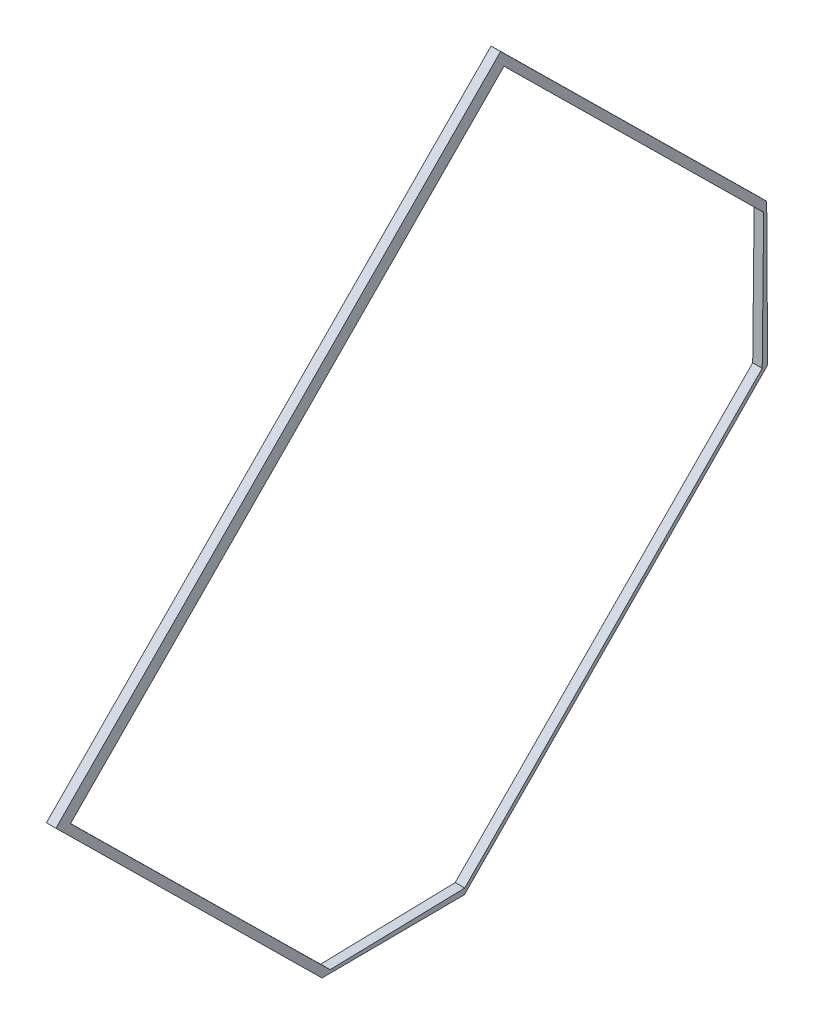
ISO-10303-21;
HEADER;
FILE_DESCRIPTION(('STEP AP214'),'2;1');
FILE_NAME('part.step','',(''),(''),'','','');
FILE_SCHEMA(('AUTOMOTIVE_DESIGN { 1 0 10303 214 1 1 1 1 }'));
ENDSEC;
DATA;
#1=APPLICATION_CONTEXT('core data for automotive mechanical design processes');
#2=APPLICATION_PROTOCOL_DEFINITION('international standard','automotive_design',2000,#1);
#3=PRODUCT_CONTEXT('',#1,'mechanical');
#4=PRODUCT('Part','Part','',(#3));
#5=PRODUCT_RELATED_PRODUCT_CATEGORY('part','',(#4));
#6=PRODUCT_DEFINITION_FORMATION('','',#4);
#7=PRODUCT_DEFINITION_CONTEXT('part definition',#1,'design');
#8=PRODUCT_DEFINITION('design','',#6,#7);
#9=PRODUCT_DEFINITION_SHAPE('','',#8);
#10=(LENGTH_UNIT() NAMED_UNIT(*) SI_UNIT(.MILLI.,.METRE.));
#11=(NAMED_UNIT(*) PLANE_ANGLE_UNIT() SI_UNIT($,.RADIAN.));
#12=(NAMED_UNIT(*) SI_UNIT($,.STERADIAN.) SOLID_ANGLE_UNIT());
#13=UNCERTAINTY_MEASURE_WITH_UNIT(LENGTH_MEASURE(1.E-05),#10,'distance_accuracy_value','');
#14=(GEOMETRIC_REPRESENTATION_CONTEXT(3) GLOBAL_UNCERTAINTY_ASSIGNED_CONTEXT((#13)) GLOBAL_UNIT_ASSIGNED_CONTEXT((#10,
#11,#12)) REPRESENTATION_CONTEXT('',''));
#15=CARTESIAN_POINT('',(0.,0.,0.));
#16=DIRECTION('',(0.,0.,1.));
#17=DIRECTION('',(1.,0.,0.));
#18=AXIS2_PLACEMENT_3D('',#15,#16,#17);
#19=CARTESIAN_POINT('',(6.7035911293097,59.99886640719,-145.054810919189));
#20=DIRECTION('',(-1.,0.,0.));
#21=DIRECTION('',(0.,0.711600971417974,-0.702583843734679));
#22=AXIS2_PLACEMENT_3D('',#19,#20,#21);
#23=PLANE('',#22);
#24=DIRECTION('',(0.,0.702583843734679,0.711600971417974));
#25=VECTOR('',#24,1.);
#26=CARTESIAN_POINT('',(6.70359112930971,197.00974177389,-6.28550548296942));
#27=LINE('',#26,#25);
#28=CARTESIAN_POINT('',(6.70359112930971,113.978246225248,-90.3826469381793));
#29=VERTEX_POINT('',#28);
#30=CARTESIAN_POINT('',(6.70359112930971,197.00974177389,-6.28550548296942));
#31=VERTEX_POINT('',#30);
#32=EDGE_CURVE('E134',#29,#31,#27,.T.);
#33=ORIENTED_EDGE('',*,*,#32,.F.);
#34=DIRECTION('',(0.,-0.999979672645485,-0.00637607213167807));
#35=VECTOR('',#34,1.);
#36=CARTESIAN_POINT('',(6.70359112930971,197.542564727174,-89.8498239848954));
#37=LINE('',#36,#35);
#38=CARTESIAN_POINT('',(6.70359112930971,68.9791609562013,-90.6695701841048));
#39=VERTEX_POINT('',#38);
#40=EDGE_CURVE('E147',#29,#39,#37,.T.);
#41=ORIENTED_EDGE('',*,*,#40,.T.);
#42=DIRECTION('',(0.,0.711600971417974,-0.702583843734679));
#43=VECTOR('',#42,1.);
#44=CARTESIAN_POINT('',(6.70359112930971,91.6221652136879,-113.025651195666));
#45=LINE('',#44,#43);
#46=CARTESIAN_POINT('',(6.70359112930971,-28.0550248124209,5.13503653970976));
#47=VERTEX_POINT('',#46);
#48=EDGE_CURVE('E153',#47,#39,#45,.T.);
#49=ORIENTED_EDGE('',*,*,#48,.F.);
#50=DIRECTION('',(0.,0.00637607213167762,-0.999979672645485));
#51=VECTOR('',#50,1.);
#52=CARTESIAN_POINT('',(6.70359112930971,-27.9730582433015,-7.72004120458201));
#53=LINE('',#52,#51);
#54=CARTESIAN_POINT('',(6.70359112930971,-28.3419480583464,50.1341218087565));
#55=VERTEX_POINT('',#54);
#56=EDGE_CURVE('E168',#55,#47,#53,.T.);
#57=ORIENTED_EDGE('',*,*,#56,.F.);
#58=DIRECTION('',(0.,0.702583843734679,0.711600971417974));
#59=VECTOR('',#58,1.);
#60=CARTESIAN_POINT('',(6.70359112930972,54.6895474902948,134.231263263966));
#61=LINE('',#60,#59);
#62=CARTESIAN_POINT('',(6.70359112930972,54.6895474902948,134.231263263966));
#63=VERTEX_POINT('',#62);
#64=EDGE_CURVE('E200',#55,#63,#61,.T.);
#65=ORIENTED_EDGE('',*,*,#64,.T.);
#66=DIRECTION('',(0.,0.711600971417974,-0.702583843734679));
#67=VECTOR('',#66,1.);
#68=CARTESIAN_POINT('',(6.70359112930971,197.00974177389,-6.28550548296942));
#69=LINE('',#68,#67);
#70=EDGE_CURVE('E150',#63,#31,#69,.T.);
#71=ORIENTED_EDGE('',*,*,#70,.T.);
#72=EDGE_LOOP('',(#33,#41,#49,#57,#65,#71));
#73=FACE_BOUND('',#72,.T.);
#74=DIRECTION('',(0.,0.702583843734679,0.711600971417974));
#75=VECTOR('',#74,1.);
#76=CARTESIAN_POINT('',(6.70359112930971,9.04414046674892,84.4417380839163));
#77=LINE('',#76,#75);
#78=CARTESIAN_POINT('',(6.70359112930971,-27.3421119487814,47.5884958751061));
#79=VERTEX_POINT('',#78);
#80=CARTESIAN_POINT('',(6.70359112930972,53.658214543901,129.628399768958));
#81=VERTEX_POINT('',#80);
#82=EDGE_CURVE('E193',#79,#81,#77,.T.);
#83=ORIENTED_EDGE('',*,*,#82,.F.);
#84=DIRECTION('',(0.,0.0251431849533066,-0.999683860153001));
#85=VECTOR('',#84,1.);
#86=CARTESIAN_POINT('',(6.70359112930971,-26.272334216779,5.05452356332745));
#87=LINE('',#86,#85);
#88=CARTESIAN_POINT('',(6.70359112930971,-26.272334216779,5.05452356332745));
#89=VERTEX_POINT('',#88);
#90=EDGE_CURVE('E161',#79,#89,#87,.T.);
#91=ORIENTED_EDGE('',*,*,#90,.T.);
#92=DIRECTION('',(0.,0.711600971417974,-0.702583843734679));
#93=VECTOR('',#92,1.);
#94=CARTESIAN_POINT('',(6.70359112930971,68.9559429617379,-88.9670583338888));
#95=LINE('',#94,#93);
#96=CARTESIAN_POINT('',(6.70359112930971,68.9559429617379,-88.9670583338888));
#97=VERTEX_POINT('',#96);
#98=EDGE_CURVE('E202',#89,#97,#95,.T.);
#99=ORIENTED_EDGE('',*,*,#98,.T.);
#100=DIRECTION('',(0.,0.999944279172283,-0.0105564459276173));
#101=VECTOR('',#100,1.);
#102=CARTESIAN_POINT('',(6.70359112930971,111.420077477724,-89.4153536531561));
#103=LINE('',#102,#101);
#104=CARTESIAN_POINT('',(6.70359112930971,111.420077477724,-89.4153536531561));
#105=VERTEX_POINT('',#104);
#106=EDGE_CURVE('E158',#97,#105,#103,.T.);
#107=ORIENTED_EDGE('',*,*,#106,.T.);
#108=DIRECTION('',(0.,-0.702583843734679,-0.711600971417974));
#109=VECTOR('',#108,1.);
#110=CARTESIAN_POINT('',(6.70359112930971,149.562789502591,-50.7831090158011));
#111=LINE('',#110,#109);
#112=CARTESIAN_POINT('',(6.70359112930971,192.420403970406,-7.37544975930461));
#113=VERTEX_POINT('',#112);
#114=EDGE_CURVE('E152',#113,#105,#111,.T.);
#115=ORIENTED_EDGE('',*,*,#114,.F.);
#116=DIRECTION('',(0.,-0.711600971417974,0.702583843734679));
#117=VECTOR('',#116,1.);
#118=CARTESIAN_POINT('',(6.70359112930971,192.420403970406,-7.37544975930461));
#119=LINE('',#118,#117);
#120=EDGE_CURVE('E205',#113,#81,#119,.T.);
#121=ORIENTED_EDGE('',*,*,#120,.T.);
#122=EDGE_LOOP('',(#83,#91,#99,#107,#115,#121));
#123=FACE_BOUND('',#122,.T.);
#124=ADVANCED_FACE('F39',(#73,#123),#23,.T.);
#125=CARTESIAN_POINT('',(-16.2926616898093,197.00974177389,-6.28550548296942));
#126=DIRECTION('',(0.,-0.702583843734678,-0.711600971417974));
#127=DIRECTION('',(1.,0.,0.));
#128=AXIS2_PLACEMENT_3D('',#125,#126,#127);
#129=PLANE('',#128);
#130=ORIENTED_EDGE('',*,*,#70,.F.);
#131=DIRECTION('',(-1.,0.,0.));
#132=VECTOR('',#131,1.);
#133=CARTESIAN_POINT('',(9.70733831019067,54.6895474902948,134.231263263966));
#134=LINE('',#133,#132);
#135=CARTESIAN_POINT('',(9.70733831019067,54.6895474902948,134.231263263966));
#136=VERTEX_POINT('',#135);
#137=EDGE_CURVE('E165',#136,#63,#134,.T.);
#138=ORIENTED_EDGE('',*,*,#137,.F.);
#139=DIRECTION('',(0.,-0.711600971417974,0.702583843734679));
#140=VECTOR('',#139,1.);
#141=CARTESIAN_POINT('',(9.70733831019066,197.00974177389,-6.28550548296942));
#142=LINE('',#141,#140);
#143=CARTESIAN_POINT('',(9.70733831019066,197.00974177389,-6.28550548296942));
#144=VERTEX_POINT('',#143);
#145=EDGE_CURVE('E187',#144,#136,#142,.T.);
#146=ORIENTED_EDGE('',*,*,#145,.F.);
#147=DIRECTION('',(-1.,0.,0.));
#148=VECTOR('',#147,1.);
#149=CARTESIAN_POINT('',(9.70733831019066,197.00974177389,-6.28550548296942));
#150=LINE('',#149,#148);
#151=EDGE_CURVE('E167',#144,#31,#150,.T.);
#152=ORIENTED_EDGE('',*,*,#151,.T.);
#153=EDGE_LOOP('',(#130,#138,#146,#152));
#154=FACE_BOUND('',#153,.T.);
#155=ADVANCED_FACE('F251',(#154),#129,.F.);
#156=CARTESIAN_POINT('',(-16.2926616898093,149.562789502591,-50.7831090158011));
#157=DIRECTION('',(0.,-0.711600971417974,0.702583843734679));
#158=DIRECTION('',(0.,-0.702583843734679,-0.711600971417974));
#159=AXIS2_PLACEMENT_3D('',#156,#157,#158);
#160=PLANE('',#159);
#161=DIRECTION('',(1.,0.,0.));
#162=VECTOR('',#161,1.);
#163=CARTESIAN_POINT('',(-16.2926616898093,192.420403970406,-7.37544975930461));
#164=LINE('',#163,#162);
#165=CARTESIAN_POINT('',(9.70733831019066,192.420403970406,-7.37544975930461));
#166=VERTEX_POINT('',#165);
#167=EDGE_CURVE('E54',#113,#166,#164,.T.);
#168=ORIENTED_EDGE('',*,*,#167,.F.);
#169=ORIENTED_EDGE('',*,*,#114,.T.);
#170=DIRECTION('',(1.,0.,0.));
#171=VECTOR('',#170,1.);
#172=CARTESIAN_POINT('',(-16.2926616898093,111.420077477724,-89.4153536531561));
#173=LINE('',#172,#171);
#174=CARTESIAN_POINT('',(9.70733831019066,111.420077477724,-89.4153536531561));
#175=VERTEX_POINT('',#174);
#176=EDGE_CURVE('E181',#105,#175,#173,.T.);
#177=ORIENTED_EDGE('',*,*,#176,.T.);
#178=DIRECTION('',(0.,0.702583843734678,0.711600971417975));
#179=VECTOR('',#178,1.);
#180=CARTESIAN_POINT('',(9.70733831019066,111.420077477724,-89.4153536531561));
#181=LINE('',#180,#179);
#182=EDGE_CURVE('E170',#175,#166,#181,.T.);
#183=ORIENTED_EDGE('',*,*,#182,.T.);
#184=EDGE_LOOP('',(#168,#169,#177,#183));
#185=FACE_BOUND('',#184,.T.);
#186=ADVANCED_FACE('F265',(#185),#160,.T.);
#187=CARTESIAN_POINT('',(9.70733831019066,197.00974177389,-6.28550548296942));
#188=DIRECTION('',(1.,0.,0.));
#189=DIRECTION('',(0.,-0.711600971417974,0.702583843734679));
#190=AXIS2_PLACEMENT_3D('',#187,#188,#189);
#191=PLANE('',#190);
#192=ORIENTED_EDGE('',*,*,#182,.F.);
#193=DIRECTION('',(0.,0.999944279172283,-0.0105564459276174));
#194=VECTOR('',#193,1.);
#195=CARTESIAN_POINT('',(9.70733831019066,111.420077477724,-89.4153536531561));
#196=LINE('',#195,#194);
#197=CARTESIAN_POINT('',(9.70733831019066,68.9559429617379,-88.9670583338888));
#198=VERTEX_POINT('',#197);
#199=EDGE_CURVE('E173',#198,#175,#196,.T.);
#200=ORIENTED_EDGE('',*,*,#199,.F.);
#201=DIRECTION('',(0.,0.711600971417974,-0.702583843734679));
#202=VECTOR('',#201,1.);
#203=CARTESIAN_POINT('',(9.70733831019066,68.9559429617379,-88.9670583338888));
#204=LINE('',#203,#202);
#205=CARTESIAN_POINT('',(9.70733831019066,-26.272334216779,5.05452356332745));
#206=VERTEX_POINT('',#205);
#207=EDGE_CURVE('E222',#206,#198,#204,.T.);
#208=ORIENTED_EDGE('',*,*,#207,.F.);
#209=DIRECTION('',(0.,0.0251431849533066,-0.999683860153));
#210=VECTOR('',#209,1.);
#211=CARTESIAN_POINT('',(9.70733831019066,-26.272334216779,5.05452356332745));
#212=LINE('',#211,#210);
#213=CARTESIAN_POINT('',(9.70733831019066,-27.3421119487814,47.5884958751061));
#214=VERTEX_POINT('',#213);
#215=EDGE_CURVE('E217',#214,#206,#212,.T.);
#216=ORIENTED_EDGE('',*,*,#215,.F.);
#217=DIRECTION('',(0.,-0.702583843734679,-0.711600971417974));
#218=VECTOR('',#217,1.);
#219=CARTESIAN_POINT('',(9.70733831019066,-27.3421119487814,47.5884958751061));
#220=LINE('',#219,#218);
#221=CARTESIAN_POINT('',(9.70733831019067,53.658214543901,129.628399768958));
#222=VERTEX_POINT('',#221);
#223=EDGE_CURVE('E236',#222,#214,#220,.T.);
#224=ORIENTED_EDGE('',*,*,#223,.F.);
#225=DIRECTION('',(0.,-0.711600971417974,0.702583843734679));
#226=VECTOR('',#225,1.);
#227=CARTESIAN_POINT('',(9.70733831019066,192.420403970406,-7.37544975930461));
#228=LINE('',#227,#226);
#229=EDGE_CURVE('E232',#166,#222,#228,.T.);
#230=ORIENTED_EDGE('',*,*,#229,.F.);
#231=EDGE_LOOP('',(#192,#200,#208,#216,#224,#230));
#232=FACE_BOUND('',#231,.T.);
#233=DIRECTION('',(0.,-0.00637607213167762,0.999979672645485));
#234=VECTOR('',#233,1.);
#235=CARTESIAN_POINT('',(9.70733831019066,-27.9730582433015,-7.72004120458201));
#236=LINE('',#235,#234);
#237=CARTESIAN_POINT('',(9.70733831019066,-28.0550248124209,5.13503653970976));
#238=VERTEX_POINT('',#237);
#239=CARTESIAN_POINT('',(9.70733831019066,-28.3419480583464,50.1341218087565));
#240=VERTEX_POINT('',#239);
#241=EDGE_CURVE('E183',#238,#240,#236,.T.);
#242=ORIENTED_EDGE('',*,*,#241,.F.);
#243=DIRECTION('',(0.,0.711600971417974,-0.702583843734679));
#244=VECTOR('',#243,1.);
#245=CARTESIAN_POINT('',(9.70733831019066,91.6221652136879,-113.025651195666));
#246=LINE('',#245,#244);
#247=CARTESIAN_POINT('',(9.70733831019066,68.9791609562013,-90.6695701841048));
#248=VERTEX_POINT('',#247);
#249=EDGE_CURVE('E246',#238,#248,#246,.T.);
#250=ORIENTED_EDGE('',*,*,#249,.T.);
#251=DIRECTION('',(0.,0.999979672645485,0.00637607213167801));
#252=VECTOR('',#251,1.);
#253=CARTESIAN_POINT('',(9.70733831019066,197.542564727174,-89.8498239848954));
#254=LINE('',#253,#252);
#255=CARTESIAN_POINT('',(9.70733831019066,113.978246225248,-90.3826469381793));
#256=VERTEX_POINT('',#255);
#257=EDGE_CURVE('E248',#248,#256,#254,.T.);
#258=ORIENTED_EDGE('',*,*,#257,.T.);
#259=DIRECTION('',(0.,0.702583843734679,0.711600971417974));
#260=VECTOR('',#259,1.);
#261=CARTESIAN_POINT('',(9.70733831019066,197.00974177389,-6.28550548296942));
#262=LINE('',#261,#260);
#263=EDGE_CURVE('E137',#256,#144,#262,.T.);
#264=ORIENTED_EDGE('',*,*,#263,.T.);
#265=ORIENTED_EDGE('',*,*,#145,.T.);
#266=DIRECTION('',(0.,-0.702583843734679,-0.711600971417974));
#267=VECTOR('',#266,1.);
#268=CARTESIAN_POINT('',(9.70733831019067,54.6895474902948,134.231263263966));
#269=LINE('',#268,#267);
#270=EDGE_CURVE('E62',#136,#240,#269,.T.);
#271=ORIENTED_EDGE('',*,*,#270,.T.);
#272=EDGE_LOOP('',(#242,#250,#258,#264,#265,#271));
#273=FACE_BOUND('',#272,.T.);
#274=ADVANCED_FACE('F239',(#232,#273),#191,.T.);
#275=CARTESIAN_POINT('',(-16.2926616898093,91.6221652136879,-113.025651195666));
#276=DIRECTION('',(0.,-0.702583843734678,-0.711600971417974));
#277=DIRECTION('',(1.,0.,0.));
#278=AXIS2_PLACEMENT_3D('',#275,#276,#277);
#279=PLANE('',#278);
#280=DIRECTION('',(-1.,0.,0.));
#281=VECTOR('',#280,1.);
#282=CARTESIAN_POINT('',(9.70733831019066,-28.0550248124209,5.13503653970976));
#283=LINE('',#282,#281);
#284=EDGE_CURVE('E11',#238,#47,#283,.T.);
#285=ORIENTED_EDGE('',*,*,#284,.T.);
#286=ORIENTED_EDGE('',*,*,#48,.T.);
#287=DIRECTION('',(-1.,0.,0.));
#288=VECTOR('',#287,1.);
#289=CARTESIAN_POINT('',(9.70733831019066,68.9791609562013,-90.6695701841048));
#290=LINE('',#289,#288);
#291=EDGE_CURVE('E47',#248,#39,#290,.T.);
#292=ORIENTED_EDGE('',*,*,#291,.F.);
#293=ORIENTED_EDGE('',*,*,#249,.F.);
#294=EDGE_LOOP('',(#285,#286,#292,#293));
#295=FACE_BOUND('',#294,.T.);
#296=ADVANCED_FACE('F257',(#295),#279,.T.);
#297=CARTESIAN_POINT('',(-16.2926616898093,54.6895474902948,134.231263263966));
#298=DIRECTION('',(0.,0.711600971417974,-0.702583843734678));
#299=DIRECTION('',(1.,0.,0.));
#300=AXIS2_PLACEMENT_3D('',#297,#298,#299);
#301=PLANE('',#300);
#302=ORIENTED_EDGE('',*,*,#64,.F.);
#303=DIRECTION('',(-1.,0.,0.));
#304=VECTOR('',#303,1.);
#305=CARTESIAN_POINT('',(9.70733831019066,-28.3419480583464,50.1341218087565));
#306=LINE('',#305,#304);
#307=EDGE_CURVE('E141',#240,#55,#306,.T.);
#308=ORIENTED_EDGE('',*,*,#307,.F.);
#309=ORIENTED_EDGE('',*,*,#270,.F.);
#310=ORIENTED_EDGE('',*,*,#137,.T.);
#311=EDGE_LOOP('',(#302,#308,#309,#310));
#312=FACE_BOUND('',#311,.T.);
#313=ADVANCED_FACE('F254',(#312),#301,.F.);
#314=CARTESIAN_POINT('',(9.70733831019066,-27.9730582433015,-7.72004120458201));
#315=DIRECTION('',(0.,-0.999979672645485,-0.00637607213167762));
#316=DIRECTION('',(0.,0.00637607213167762,-0.999979672645485));
#317=AXIS2_PLACEMENT_3D('',#314,#315,#316);
#318=PLANE('',#317);
#319=ORIENTED_EDGE('',*,*,#307,.T.);
#320=ORIENTED_EDGE('',*,*,#56,.T.);
#321=ORIENTED_EDGE('',*,*,#284,.F.);
#322=ORIENTED_EDGE('',*,*,#241,.T.);
#323=EDGE_LOOP('',(#319,#320,#321,#322));
#324=FACE_BOUND('',#323,.T.);
#325=ADVANCED_FACE('F41',(#324),#318,.T.);
#326=CARTESIAN_POINT('',(-16.2926616898093,197.00974177389,-6.28550548296942));
#327=DIRECTION('',(0.,0.711600971417974,-0.702583843734678));
#328=DIRECTION('',(1.,0.,0.));
#329=AXIS2_PLACEMENT_3D('',#326,#327,#328);
#330=PLANE('',#329);
#331=DIRECTION('',(-1.,0.,0.));
#332=VECTOR('',#331,1.);
#333=CARTESIAN_POINT('',(9.70733831019066,113.978246225248,-90.3826469381793));
#334=LINE('',#333,#332);
#335=EDGE_CURVE('E131',#256,#29,#334,.T.);
#336=ORIENTED_EDGE('',*,*,#335,.T.);
#337=ORIENTED_EDGE('',*,*,#32,.T.);
#338=ORIENTED_EDGE('',*,*,#151,.F.);
#339=ORIENTED_EDGE('',*,*,#263,.F.);
#340=EDGE_LOOP('',(#336,#337,#338,#339));
#341=FACE_BOUND('',#340,.T.);
#342=ADVANCED_FACE('F133',(#341),#330,.T.);
#343=CARTESIAN_POINT('',(9.70733831019066,197.542564727174,-89.8498239848954));
#344=DIRECTION('',(0.,-0.00637607213167807,0.999979672645485));
#345=DIRECTION('',(0.,-0.999979672645485,-0.00637607213167807));
#346=AXIS2_PLACEMENT_3D('',#343,#344,#345);
#347=PLANE('',#346);
#348=ORIENTED_EDGE('',*,*,#40,.F.);
#349=ORIENTED_EDGE('',*,*,#335,.F.);
#350=ORIENTED_EDGE('',*,*,#257,.F.);
#351=ORIENTED_EDGE('',*,*,#291,.T.);
#352=EDGE_LOOP('',(#348,#349,#350,#351));
#353=FACE_BOUND('',#352,.T.);
#354=ADVANCED_FACE('F155',(#353),#347,.F.);
#355=CARTESIAN_POINT('',(-16.2926616898093,68.9559429617379,-88.9670583338888));
#356=DIRECTION('',(0.,-0.702583843734678,-0.711600971417974));
#357=DIRECTION('',(1.,0.,0.));
#358=AXIS2_PLACEMENT_3D('',#355,#356,#357);
#359=PLANE('',#358);
#360=ORIENTED_EDGE('',*,*,#98,.F.);
#361=DIRECTION('',(1.,0.,0.));
#362=VECTOR('',#361,1.);
#363=CARTESIAN_POINT('',(-16.2926616898093,-26.272334216779,5.05452356332745));
#364=LINE('',#363,#362);
#365=EDGE_CURVE('E177',#89,#206,#364,.T.);
#366=ORIENTED_EDGE('',*,*,#365,.T.);
#367=ORIENTED_EDGE('',*,*,#207,.T.);
#368=DIRECTION('',(1.,0.,0.));
#369=VECTOR('',#368,1.);
#370=CARTESIAN_POINT('',(-16.2926616898093,68.9559429617379,-88.9670583338888));
#371=LINE('',#370,#369);
#372=EDGE_CURVE('E179',#97,#198,#371,.T.);
#373=ORIENTED_EDGE('',*,*,#372,.F.);
#374=EDGE_LOOP('',(#360,#366,#367,#373));
#375=FACE_BOUND('',#374,.T.);
#376=ADVANCED_FACE('F221',(#375),#359,.F.);
#377=CARTESIAN_POINT('',(-16.2926616898093,111.420077477724,-89.4153536531561));
#378=DIRECTION('',(0.,-0.0105564459276173,-0.999944279172283));
#379=DIRECTION('',(0.,0.999944279172283,-0.0105564459276173));
#380=AXIS2_PLACEMENT_3D('',#377,#378,#379);
#381=PLANE('',#380);
#382=ORIENTED_EDGE('',*,*,#106,.F.);
#383=ORIENTED_EDGE('',*,*,#372,.T.);
#384=ORIENTED_EDGE('',*,*,#199,.T.);
#385=ORIENTED_EDGE('',*,*,#176,.F.);
#386=EDGE_LOOP('',(#382,#383,#384,#385));
#387=FACE_BOUND('',#386,.T.);
#388=ADVANCED_FACE('F226',(#387),#381,.F.);
#389=CARTESIAN_POINT('',(-16.2926616898093,9.04414046674892,84.4417380839163));
#390=DIRECTION('',(0.,0.711600971417974,-0.702583843734679));
#391=DIRECTION('',(0.,0.702583843734679,0.711600971417974));
#392=AXIS2_PLACEMENT_3D('',#389,#390,#391);
#393=PLANE('',#392);
#394=DIRECTION('',(1.,0.,0.));
#395=VECTOR('',#394,1.);
#396=CARTESIAN_POINT('',(-16.2926616898093,-27.3421119487814,47.5884958751062));
#397=LINE('',#396,#395);
#398=EDGE_CURVE('E175',#79,#214,#397,.T.);
#399=ORIENTED_EDGE('',*,*,#398,.F.);
#400=ORIENTED_EDGE('',*,*,#82,.T.);
#401=DIRECTION('',(1.,0.,0.));
#402=VECTOR('',#401,1.);
#403=CARTESIAN_POINT('',(-16.2926616898093,53.658214543901,129.628399768958));
#404=LINE('',#403,#402);
#405=EDGE_CURVE('E172',#81,#222,#404,.T.);
#406=ORIENTED_EDGE('',*,*,#405,.T.);
#407=ORIENTED_EDGE('',*,*,#223,.T.);
#408=EDGE_LOOP('',(#399,#400,#406,#407));
#409=FACE_BOUND('',#408,.T.);
#410=ADVANCED_FACE('F235',(#409),#393,.T.);
#411=CARTESIAN_POINT('',(-16.2926616898093,-26.272334216779,5.05452356332745));
#412=DIRECTION('',(0.,-0.999683860153,-0.0251431849533066));
#413=DIRECTION('',(0.,0.0251431849533066,-0.999683860153001));
#414=AXIS2_PLACEMENT_3D('',#411,#412,#413);
#415=PLANE('',#414);
#416=ORIENTED_EDGE('',*,*,#90,.F.);
#417=ORIENTED_EDGE('',*,*,#398,.T.);
#418=ORIENTED_EDGE('',*,*,#215,.T.);
#419=ORIENTED_EDGE('',*,*,#365,.F.);
#420=EDGE_LOOP('',(#416,#417,#418,#419));
#421=FACE_BOUND('',#420,.T.);
#422=ADVANCED_FACE('F213',(#421),#415,.F.);
#423=CARTESIAN_POINT('',(-16.2926616898093,192.420403970406,-7.37544975930461));
#424=DIRECTION('',(0.,0.702583843734678,0.711600971417974));
#425=DIRECTION('',(-1.,0.,0.));
#426=AXIS2_PLACEMENT_3D('',#423,#424,#425);
#427=PLANE('',#426);
#428=ORIENTED_EDGE('',*,*,#120,.F.);
#429=ORIENTED_EDGE('',*,*,#167,.T.);
#430=ORIENTED_EDGE('',*,*,#229,.T.);
#431=ORIENTED_EDGE('',*,*,#405,.F.);
#432=EDGE_LOOP('',(#428,#429,#430,#431));
#433=FACE_BOUND('',#432,.T.);
#434=ADVANCED_FACE('F230',(#433),#427,.F.);
#435=CLOSED_SHELL('',(#124,#155,#186,#274,#296,#313,#325,#342,#354,#376,#388,#410,#422,#434));
#436=MANIFOLD_SOLID_BREP('B2',#435);
#437=ADVANCED_BREP_SHAPE_REPRESENTATION('',(#18,#436),#14);
#438=SHAPE_DEFINITION_REPRESENTATION(#9,#437);
ENDSEC;
END-ISO-10303-21;
